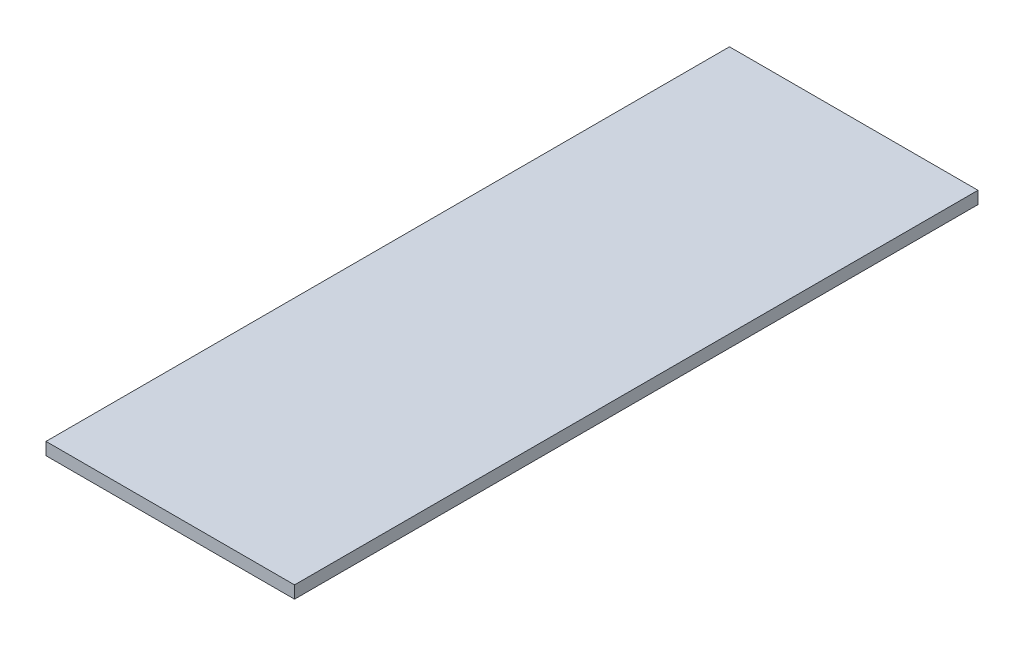
ISO-10303-21;
HEADER;
FILE_DESCRIPTION(('STEP AP214'),'2;1');
FILE_NAME('part.step','',(''),(''),'','','');
FILE_SCHEMA(('AUTOMOTIVE_DESIGN { 1 0 10303 214 1 1 1 1 }'));
ENDSEC;
DATA;
#1=APPLICATION_CONTEXT('core data for automotive mechanical design processes');
#2=APPLICATION_PROTOCOL_DEFINITION('international standard','automotive_design',2000,#1);
#3=PRODUCT_CONTEXT('',#1,'mechanical');
#4=PRODUCT('Part','Part','',(#3));
#5=PRODUCT_RELATED_PRODUCT_CATEGORY('part','',(#4));
#6=PRODUCT_DEFINITION_FORMATION('','',#4);
#7=PRODUCT_DEFINITION_CONTEXT('part definition',#1,'design');
#8=PRODUCT_DEFINITION('design','',#6,#7);
#9=PRODUCT_DEFINITION_SHAPE('','',#8);
#10=(LENGTH_UNIT() NAMED_UNIT(*) SI_UNIT(.MILLI.,.METRE.));
#11=(NAMED_UNIT(*) PLANE_ANGLE_UNIT() SI_UNIT($,.RADIAN.));
#12=(NAMED_UNIT(*) SI_UNIT($,.STERADIAN.) SOLID_ANGLE_UNIT());
#13=UNCERTAINTY_MEASURE_WITH_UNIT(LENGTH_MEASURE(1.E-05),#10,'distance_accuracy_value','');
#14=(GEOMETRIC_REPRESENTATION_CONTEXT(3) GLOBAL_UNCERTAINTY_ASSIGNED_CONTEXT((#13)) GLOBAL_UNIT_ASSIGNED_CONTEXT((#10,
#11,#12)) REPRESENTATION_CONTEXT('',''));
#15=CARTESIAN_POINT('',(0.,0.,0.));
#16=DIRECTION('',(0.,0.,1.));
#17=DIRECTION('',(1.,0.,0.));
#18=AXIS2_PLACEMENT_3D('',#15,#16,#17);
#19=CARTESIAN_POINT('',(12.7,1.27,34.925));
#20=DIRECTION('',(-1.,0.,0.));
#21=DIRECTION('',(0.,0.,1.));
#22=AXIS2_PLACEMENT_3D('',#19,#20,#21);
#23=PLANE('',#22);
#24=DIRECTION('',(0.,0.,-1.));
#25=VECTOR('',#24,1.);
#26=CARTESIAN_POINT('',(12.7,0.,34.925));
#27=LINE('',#26,#25);
#28=CARTESIAN_POINT('',(12.7,0.,34.925));
#29=VERTEX_POINT('',#28);
#30=CARTESIAN_POINT('',(12.7,0.,-34.925));
#31=VERTEX_POINT('',#30);
#32=EDGE_CURVE('E96',#29,#31,#27,.T.);
#33=ORIENTED_EDGE('',*,*,#32,.T.);
#34=DIRECTION('',(0.,-1.,0.));
#35=VECTOR('',#34,1.);
#36=CARTESIAN_POINT('',(12.7,1.27,-34.925));
#37=LINE('',#36,#35);
#38=CARTESIAN_POINT('',(12.7,1.27,-34.925));
#39=VERTEX_POINT('',#38);
#40=EDGE_CURVE('E11',#39,#31,#37,.T.);
#41=ORIENTED_EDGE('',*,*,#40,.F.);
#42=DIRECTION('',(0.,0.,-1.));
#43=VECTOR('',#42,1.);
#44=CARTESIAN_POINT('',(12.7,1.27,34.925));
#45=LINE('',#44,#43);
#46=CARTESIAN_POINT('',(12.7,1.27,34.925));
#47=VERTEX_POINT('',#46);
#48=EDGE_CURVE('E84',#47,#39,#45,.T.);
#49=ORIENTED_EDGE('',*,*,#48,.F.);
#50=DIRECTION('',(0.,-1.,0.));
#51=VECTOR('',#50,1.);
#52=CARTESIAN_POINT('',(12.7,1.27,34.925));
#53=LINE('',#52,#51);
#54=EDGE_CURVE('E92',#47,#29,#53,.T.);
#55=ORIENTED_EDGE('',*,*,#54,.T.);
#56=EDGE_LOOP('',(#33,#41,#49,#55));
#57=FACE_BOUND('',#56,.T.);
#58=ADVANCED_FACE('F33',(#57),#23,.F.);
#59=CARTESIAN_POINT('',(-12.7,1.27,-34.925));
#60=DIRECTION('',(0.,0.,1.));
#61=DIRECTION('',(1.,0.,0.));
#62=AXIS2_PLACEMENT_3D('',#59,#60,#61);
#63=PLANE('',#62);
#64=DIRECTION('',(-1.,0.,0.));
#65=VECTOR('',#64,1.);
#66=CARTESIAN_POINT('',(-12.7,0.,-34.925));
#67=LINE('',#66,#65);
#68=CARTESIAN_POINT('',(-12.7,0.,-34.925));
#69=VERTEX_POINT('',#68);
#70=EDGE_CURVE('E88',#31,#69,#67,.T.);
#71=ORIENTED_EDGE('',*,*,#70,.T.);
#72=DIRECTION('',(0.,-1.,0.));
#73=VECTOR('',#72,1.);
#74=CARTESIAN_POINT('',(-12.7,1.27,-34.925));
#75=LINE('',#74,#73);
#76=CARTESIAN_POINT('',(-12.7,1.27,-34.925));
#77=VERTEX_POINT('',#76);
#78=EDGE_CURVE('E41',#77,#69,#75,.T.);
#79=ORIENTED_EDGE('',*,*,#78,.F.);
#80=DIRECTION('',(-1.,0.,0.));
#81=VECTOR('',#80,1.);
#82=CARTESIAN_POINT('',(-12.7,1.27,-34.925));
#83=LINE('',#82,#81);
#84=EDGE_CURVE('E79',#39,#77,#83,.T.);
#85=ORIENTED_EDGE('',*,*,#84,.F.);
#86=ORIENTED_EDGE('',*,*,#40,.T.);
#87=EDGE_LOOP('',(#71,#79,#85,#86));
#88=FACE_BOUND('',#87,.T.);
#89=ADVANCED_FACE('F87',(#88),#63,.F.);
#90=CARTESIAN_POINT('',(-12.7,1.27,34.925));
#91=DIRECTION('',(1.,0.,0.));
#92=DIRECTION('',(0.,0.,-1.));
#93=AXIS2_PLACEMENT_3D('',#90,#91,#92);
#94=PLANE('',#93);
#95=DIRECTION('',(0.,0.,1.));
#96=VECTOR('',#95,1.);
#97=CARTESIAN_POINT('',(-12.7,0.,34.925));
#98=LINE('',#97,#96);
#99=CARTESIAN_POINT('',(-12.7,0.,34.925));
#100=VERTEX_POINT('',#99);
#101=EDGE_CURVE('E66',#69,#100,#98,.T.);
#102=ORIENTED_EDGE('',*,*,#101,.T.);
#103=DIRECTION('',(0.,-1.,0.));
#104=VECTOR('',#103,1.);
#105=CARTESIAN_POINT('',(-12.7,1.27,34.925));
#106=LINE('',#105,#104);
#107=CARTESIAN_POINT('',(-12.7,1.27,34.925));
#108=VERTEX_POINT('',#107);
#109=EDGE_CURVE('E89',#108,#100,#106,.T.);
#110=ORIENTED_EDGE('',*,*,#109,.F.);
#111=DIRECTION('',(0.,0.,1.));
#112=VECTOR('',#111,1.);
#113=CARTESIAN_POINT('',(-12.7,1.27,34.925));
#114=LINE('',#113,#112);
#115=EDGE_CURVE('E82',#77,#108,#114,.T.);
#116=ORIENTED_EDGE('',*,*,#115,.F.);
#117=ORIENTED_EDGE('',*,*,#78,.T.);
#118=EDGE_LOOP('',(#102,#110,#116,#117));
#119=FACE_BOUND('',#118,.T.);
#120=ADVANCED_FACE('F90',(#119),#94,.F.);
#121=CARTESIAN_POINT('',(-12.7,1.27,34.925));
#122=DIRECTION('',(0.,0.,-1.));
#123=DIRECTION('',(-1.,0.,0.));
#124=AXIS2_PLACEMENT_3D('',#121,#122,#123);
#125=PLANE('',#124);
#126=DIRECTION('',(1.,0.,0.));
#127=VECTOR('',#126,1.);
#128=CARTESIAN_POINT('',(-12.7,0.,34.925));
#129=LINE('',#128,#127);
#130=EDGE_CURVE('E72',#100,#29,#129,.T.);
#131=ORIENTED_EDGE('',*,*,#130,.T.);
#132=ORIENTED_EDGE('',*,*,#54,.F.);
#133=DIRECTION('',(1.,0.,0.));
#134=VECTOR('',#133,1.);
#135=CARTESIAN_POINT('',(-12.7,1.27,34.925));
#136=LINE('',#135,#134);
#137=EDGE_CURVE('E49',#108,#47,#136,.T.);
#138=ORIENTED_EDGE('',*,*,#137,.F.);
#139=ORIENTED_EDGE('',*,*,#109,.T.);
#140=EDGE_LOOP('',(#131,#132,#138,#139));
#141=FACE_BOUND('',#140,.T.);
#142=ADVANCED_FACE('F103',(#141),#125,.F.);
#143=CARTESIAN_POINT('',(0.,1.27,0.));
#144=DIRECTION('',(0.,-1.,0.));
#145=DIRECTION('',(0.,0.,-1.));
#146=AXIS2_PLACEMENT_3D('',#143,#144,#145);
#147=PLANE('',#146);
#148=ORIENTED_EDGE('',*,*,#48,.T.);
#149=ORIENTED_EDGE('',*,*,#84,.T.);
#150=ORIENTED_EDGE('',*,*,#115,.T.);
#151=ORIENTED_EDGE('',*,*,#137,.T.);
#152=EDGE_LOOP('',(#148,#149,#150,#151));
#153=FACE_BOUND('',#152,.T.);
#154=ADVANCED_FACE('F80',(#153),#147,.F.);
#155=CARTESIAN_POINT('',(0.,0.,0.));
#156=DIRECTION('',(0.,-1.,0.));
#157=DIRECTION('',(0.,0.,-1.));
#158=AXIS2_PLACEMENT_3D('',#155,#156,#157);
#159=PLANE('',#158);
#160=ORIENTED_EDGE('',*,*,#32,.F.);
#161=ORIENTED_EDGE('',*,*,#130,.F.);
#162=ORIENTED_EDGE('',*,*,#101,.F.);
#163=ORIENTED_EDGE('',*,*,#70,.F.);
#164=EDGE_LOOP('',(#160,#161,#162,#163));
#165=FACE_BOUND('',#164,.T.);
#166=ADVANCED_FACE('F106',(#165),#159,.T.);
#167=CLOSED_SHELL('',(#58,#89,#120,#142,#154,#166));
#168=MANIFOLD_SOLID_BREP('B2',#167);
#169=ADVANCED_BREP_SHAPE_REPRESENTATION('',(#18,#168),#14);
#170=SHAPE_DEFINITION_REPRESENTATION(#9,#169);
ENDSEC;
END-ISO-10303-21;
